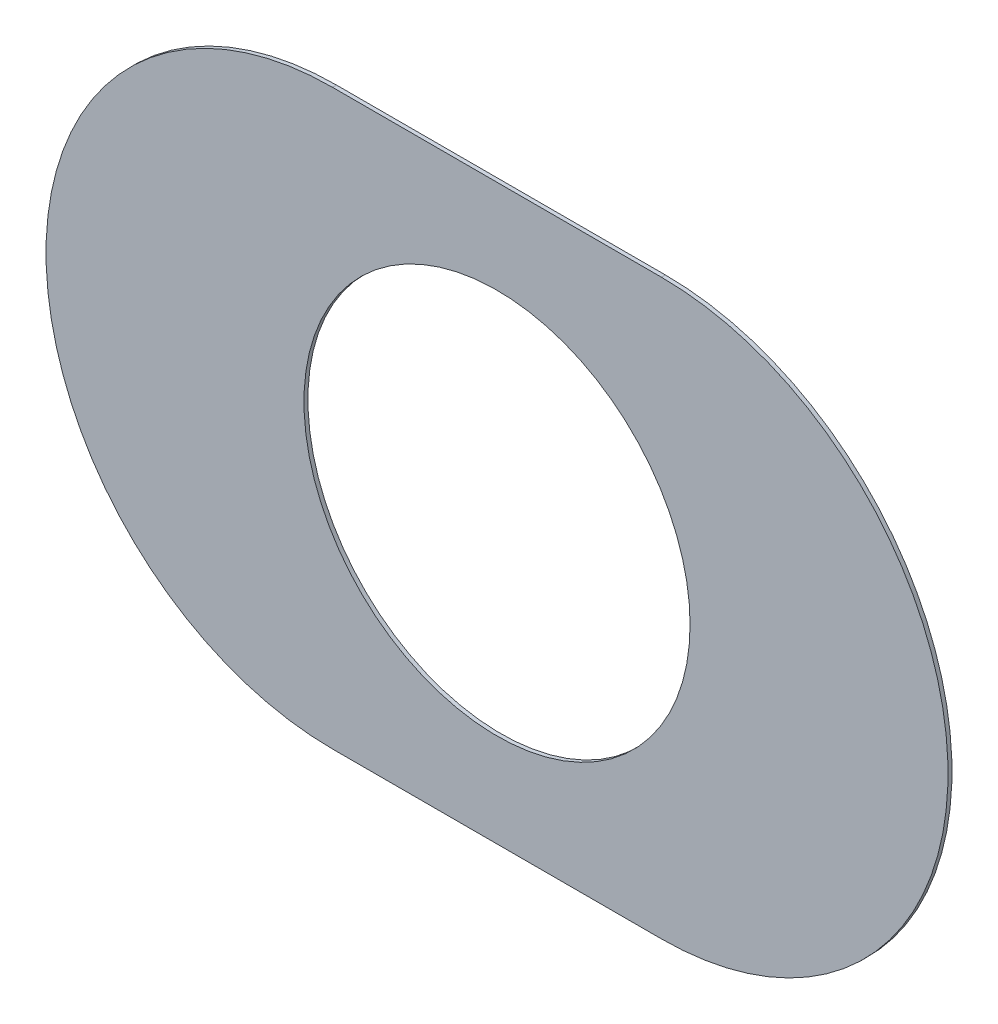
ISO-10303-21;
HEADER;
FILE_DESCRIPTION(('STEP AP214'),'2;1');
FILE_NAME('part.step','',(''),(''),'','','');
FILE_SCHEMA(('AUTOMOTIVE_DESIGN { 1 0 10303 214 1 1 1 1 }'));
ENDSEC;
DATA;
#1=APPLICATION_CONTEXT('core data for automotive mechanical design processes');
#2=APPLICATION_PROTOCOL_DEFINITION('international standard','automotive_design',2000,#1);
#3=PRODUCT_CONTEXT('',#1,'mechanical');
#4=PRODUCT('Part','Part','',(#3));
#5=PRODUCT_RELATED_PRODUCT_CATEGORY('part','',(#4));
#6=PRODUCT_DEFINITION_FORMATION('','',#4);
#7=PRODUCT_DEFINITION_CONTEXT('part definition',#1,'design');
#8=PRODUCT_DEFINITION('design','',#6,#7);
#9=PRODUCT_DEFINITION_SHAPE('','',#8);
#10=(LENGTH_UNIT() NAMED_UNIT(*) SI_UNIT(.MILLI.,.METRE.));
#11=(NAMED_UNIT(*) PLANE_ANGLE_UNIT() SI_UNIT($,.RADIAN.));
#12=(NAMED_UNIT(*) SI_UNIT($,.STERADIAN.) SOLID_ANGLE_UNIT());
#13=UNCERTAINTY_MEASURE_WITH_UNIT(LENGTH_MEASURE(1.E-05),#10,'distance_accuracy_value','');
#14=(GEOMETRIC_REPRESENTATION_CONTEXT(3) GLOBAL_UNCERTAINTY_ASSIGNED_CONTEXT((#13)) GLOBAL_UNIT_ASSIGNED_CONTEXT((#10,
#11,#12)) REPRESENTATION_CONTEXT('',''));
#15=CARTESIAN_POINT('',(0.,0.,0.));
#16=DIRECTION('',(0.,0.,1.));
#17=DIRECTION('',(1.,0.,0.));
#18=AXIS2_PLACEMENT_3D('',#15,#16,#17);
#19=CARTESIAN_POINT('',(24.3000003427268,37.4000006854535,0.));
#20=DIRECTION('',(0.,0.,1.));
#21=DIRECTION('',(1.,0.,0.));
#22=AXIS2_PLACEMENT_3D('',#19,#20,#21);
#23=PLANE('',#22);
#24=CARTESIAN_POINT('',(24.3000003427268,37.4000006854535,0.));
#25=DIRECTION('',(0.,0.,-1.));
#26=DIRECTION('',(-1.,0.,0.));
#27=AXIS2_PLACEMENT_3D('',#24,#25,#26);
#28=CIRCLE('',#27,0.49);
#29=CARTESIAN_POINT('',(24.7900003427268,37.4000006854535,0.));
#30=VERTEX_POINT('',#29);
#31=EDGE_CURVE('E110',#30,#30,#28,.T.);
#32=ORIENTED_EDGE('',*,*,#31,.T.);
#33=EDGE_LOOP('',(#32));
#34=FACE_BOUND('',#33,.T.);
#35=CARTESIAN_POINT('',(23.8825938881802,37.4000006854535,0.));
#36=DIRECTION('',(0.,0.,1.));
#37=DIRECTION('',(0.,1.,0.));
#38=AXIS2_PLACEMENT_3D('',#35,#36,#37);
#39=CIRCLE('',#38,0.727257121659981);
#40=CARTESIAN_POINT('',(23.8825938881802,38.1272578071135,0.));
#41=VERTEX_POINT('',#40);
#42=CARTESIAN_POINT('',(23.8825938881802,36.6727435637935,0.));
#43=VERTEX_POINT('',#42);
#44=EDGE_CURVE('E27',#41,#43,#39,.T.);
#45=ORIENTED_EDGE('',*,*,#44,.T.);
#46=DIRECTION('',(1.,0.,0.));
#47=VECTOR('',#46,1.);
#48=CARTESIAN_POINT('',(23.8825938881802,36.6727435637935,0.));
#49=LINE('',#48,#47);
#50=CARTESIAN_POINT('',(24.7174067972734,36.6727435637935,0.));
#51=VERTEX_POINT('',#50);
#52=EDGE_CURVE('E93',#43,#51,#49,.T.);
#53=ORIENTED_EDGE('',*,*,#52,.T.);
#54=CARTESIAN_POINT('',(24.7174067972734,37.4000006854535,0.));
#55=DIRECTION('',(0.,0.,1.));
#56=DIRECTION('',(0.,-1.,0.));
#57=AXIS2_PLACEMENT_3D('',#54,#55,#56);
#58=CIRCLE('',#57,0.727257121659981);
#59=CARTESIAN_POINT('',(24.7174067972734,38.1272578071135,0.));
#60=VERTEX_POINT('',#59);
#61=EDGE_CURVE('E116',#51,#60,#58,.T.);
#62=ORIENTED_EDGE('',*,*,#61,.T.);
#63=DIRECTION('',(-1.,0.,0.));
#64=VECTOR('',#63,1.);
#65=CARTESIAN_POINT('',(24.7174067972734,38.1272578071135,0.));
#66=LINE('',#65,#64);
#67=EDGE_CURVE('E103',#60,#41,#66,.T.);
#68=ORIENTED_EDGE('',*,*,#67,.T.);
#69=EDGE_LOOP('',(#45,#53,#62,#68));
#70=FACE_BOUND('',#69,.T.);
#71=ADVANCED_FACE('F17',(#34,#70),#23,.T.);
#72=CARTESIAN_POINT('',(24.3000003427268,37.4000006854535,-0.01));
#73=DIRECTION('',(0.,0.,1.));
#74=DIRECTION('',(1.,0.,0.));
#75=AXIS2_PLACEMENT_3D('',#72,#73,#74);
#76=PLANE('',#75);
#77=CARTESIAN_POINT('',(24.3000003427268,37.4000006854535,-0.01));
#78=DIRECTION('',(0.,0.,-1.));
#79=DIRECTION('',(-1.,0.,0.));
#80=AXIS2_PLACEMENT_3D('',#77,#78,#79);
#81=CIRCLE('',#80,0.49);
#82=CARTESIAN_POINT('',(24.7900003427268,37.4000006854535,-0.01));
#83=VERTEX_POINT('',#82);
#84=EDGE_CURVE('E121',#83,#83,#81,.T.);
#85=ORIENTED_EDGE('',*,*,#84,.F.);
#86=EDGE_LOOP('',(#85));
#87=FACE_BOUND('',#86,.T.);
#88=CARTESIAN_POINT('',(23.8825938881802,37.4000006854535,-0.01));
#89=DIRECTION('',(0.,0.,1.));
#90=DIRECTION('',(0.,1.,0.));
#91=AXIS2_PLACEMENT_3D('',#88,#89,#90);
#92=CIRCLE('',#91,0.727257121659981);
#93=CARTESIAN_POINT('',(23.8825938881802,38.1272578071135,-0.01));
#94=VERTEX_POINT('',#93);
#95=CARTESIAN_POINT('',(23.8825938881802,36.6727435637935,-0.01));
#96=VERTEX_POINT('',#95);
#97=EDGE_CURVE('E11',#94,#96,#92,.T.);
#98=ORIENTED_EDGE('',*,*,#97,.F.);
#99=DIRECTION('',(-1.,0.,0.));
#100=VECTOR('',#99,1.);
#101=CARTESIAN_POINT('',(24.7174067972734,38.1272578071135,-0.01));
#102=LINE('',#101,#100);
#103=CARTESIAN_POINT('',(24.7174067972734,38.1272578071135,-0.01));
#104=VERTEX_POINT('',#103);
#105=EDGE_CURVE('E96',#104,#94,#102,.T.);
#106=ORIENTED_EDGE('',*,*,#105,.F.);
#107=CARTESIAN_POINT('',(24.7174067972734,37.4000006854535,-0.01));
#108=DIRECTION('',(0.,0.,1.));
#109=DIRECTION('',(0.,-1.,0.));
#110=AXIS2_PLACEMENT_3D('',#107,#108,#109);
#111=CIRCLE('',#110,0.727257121659981);
#112=CARTESIAN_POINT('',(24.7174067972734,36.6727435637935,-0.01));
#113=VERTEX_POINT('',#112);
#114=EDGE_CURVE('E84',#113,#104,#111,.T.);
#115=ORIENTED_EDGE('',*,*,#114,.F.);
#116=DIRECTION('',(1.,0.,0.));
#117=VECTOR('',#116,1.);
#118=CARTESIAN_POINT('',(23.8825938881802,36.6727435637935,-0.01));
#119=LINE('',#118,#117);
#120=EDGE_CURVE('E21',#96,#113,#119,.T.);
#121=ORIENTED_EDGE('',*,*,#120,.F.);
#122=EDGE_LOOP('',(#98,#106,#115,#121));
#123=FACE_BOUND('',#122,.T.);
#124=ADVANCED_FACE('F19',(#87,#123),#76,.F.);
#125=CARTESIAN_POINT('',(23.8825938881802,37.4000006854535,0.));
#126=DIRECTION('',(0.,0.,1.));
#127=DIRECTION('',(0.,1.,0.));
#128=AXIS2_PLACEMENT_3D('',#125,#126,#127);
#129=CYLINDRICAL_SURFACE('',#128,0.727257121659981);
#130=ORIENTED_EDGE('',*,*,#44,.F.);
#131=DIRECTION('',(0.,0.,-1.));
#132=VECTOR('',#131,1.);
#133=CARTESIAN_POINT('',(23.8825938881802,38.1272578071135,0.));
#134=LINE('',#133,#132);
#135=EDGE_CURVE('E100',#41,#94,#134,.T.);
#136=ORIENTED_EDGE('',*,*,#135,.T.);
#137=ORIENTED_EDGE('',*,*,#97,.T.);
#138=DIRECTION('',(0.,0.,-1.));
#139=VECTOR('',#138,1.);
#140=CARTESIAN_POINT('',(23.8825938881802,36.6727435637935,0.));
#141=LINE('',#140,#139);
#142=EDGE_CURVE('E131',#43,#96,#141,.T.);
#143=ORIENTED_EDGE('',*,*,#142,.F.);
#144=EDGE_LOOP('',(#130,#136,#137,#143));
#145=FACE_BOUND('',#144,.T.);
#146=ADVANCED_FACE('F151',(#145),#129,.T.);
#147=CARTESIAN_POINT('',(23.8825938881802,36.6727435637935,0.));
#148=DIRECTION('',(0.,1.,0.));
#149=DIRECTION('',(1.,0.,0.));
#150=AXIS2_PLACEMENT_3D('',#147,#148,#149);
#151=PLANE('',#150);
#152=ORIENTED_EDGE('',*,*,#52,.F.);
#153=ORIENTED_EDGE('',*,*,#142,.T.);
#154=ORIENTED_EDGE('',*,*,#120,.T.);
#155=DIRECTION('',(0.,0.,-1.));
#156=VECTOR('',#155,1.);
#157=CARTESIAN_POINT('',(24.7174067972734,36.6727435637935,0.));
#158=LINE('',#157,#156);
#159=EDGE_CURVE('E91',#51,#113,#158,.T.);
#160=ORIENTED_EDGE('',*,*,#159,.F.);
#161=EDGE_LOOP('',(#152,#153,#154,#160));
#162=FACE_BOUND('',#161,.T.);
#163=ADVANCED_FACE('F133',(#162),#151,.F.);
#164=CARTESIAN_POINT('',(24.7174067972734,37.4000006854535,0.));
#165=DIRECTION('',(0.,0.,1.));
#166=DIRECTION('',(0.,-1.,0.));
#167=AXIS2_PLACEMENT_3D('',#164,#165,#166);
#168=CYLINDRICAL_SURFACE('',#167,0.727257121659981);
#169=ORIENTED_EDGE('',*,*,#61,.F.);
#170=ORIENTED_EDGE('',*,*,#159,.T.);
#171=ORIENTED_EDGE('',*,*,#114,.T.);
#172=DIRECTION('',(0.,0.,-1.));
#173=VECTOR('',#172,1.);
#174=CARTESIAN_POINT('',(24.7174067972734,38.1272578071135,0.));
#175=LINE('',#174,#173);
#176=EDGE_CURVE('E88',#60,#104,#175,.T.);
#177=ORIENTED_EDGE('',*,*,#176,.F.);
#178=EDGE_LOOP('',(#169,#170,#171,#177));
#179=FACE_BOUND('',#178,.T.);
#180=ADVANCED_FACE('F86',(#179),#168,.T.);
#181=CARTESIAN_POINT('',(24.7174067972734,38.1272578071135,0.));
#182=DIRECTION('',(0.,-1.,0.));
#183=DIRECTION('',(0.,0.,-1.));
#184=AXIS2_PLACEMENT_3D('',#181,#182,#183);
#185=PLANE('',#184);
#186=ORIENTED_EDGE('',*,*,#67,.F.);
#187=ORIENTED_EDGE('',*,*,#176,.T.);
#188=ORIENTED_EDGE('',*,*,#105,.T.);
#189=ORIENTED_EDGE('',*,*,#135,.F.);
#190=EDGE_LOOP('',(#186,#187,#188,#189));
#191=FACE_BOUND('',#190,.T.);
#192=ADVANCED_FACE('F102',(#191),#185,.F.);
#193=CARTESIAN_POINT('',(24.3000003427268,37.4000006854535,0.));
#194=DIRECTION('',(0.,0.,1.));
#195=DIRECTION('',(-1.,0.,0.));
#196=AXIS2_PLACEMENT_3D('',#193,#194,#195);
#197=CYLINDRICAL_SURFACE('',#196,0.49);
#198=ORIENTED_EDGE('',*,*,#84,.T.);
#199=DIRECTION('',(0.,0.,1.));
#200=VECTOR('',#199,1.);
#201=CARTESIAN_POINT('',(24.7900003427268,37.4000006854535,0.));
#202=LINE('',#201,#200);
#203=EDGE_CURVE('E114',#83,#30,#202,.T.);
#204=ORIENTED_EDGE('',*,*,#203,.T.);
#205=ORIENTED_EDGE('',*,*,#31,.F.);
#206=ORIENTED_EDGE('',*,*,#203,.F.);
#207=EDGE_LOOP('',(#198,#204,#205,#206));
#208=FACE_BOUND('',#207,.T.);
#209=ADVANCED_FACE('F147',(#208),#197,.F.);
#210=CLOSED_SHELL('',(#71,#124,#146,#163,#180,#192,#209));
#211=MANIFOLD_SOLID_BREP('B1',#210);
#212=ADVANCED_BREP_SHAPE_REPRESENTATION('',(#18,#211),#14);
#213=SHAPE_DEFINITION_REPRESENTATION(#9,#212);
ENDSEC;
END-ISO-10303-21;
